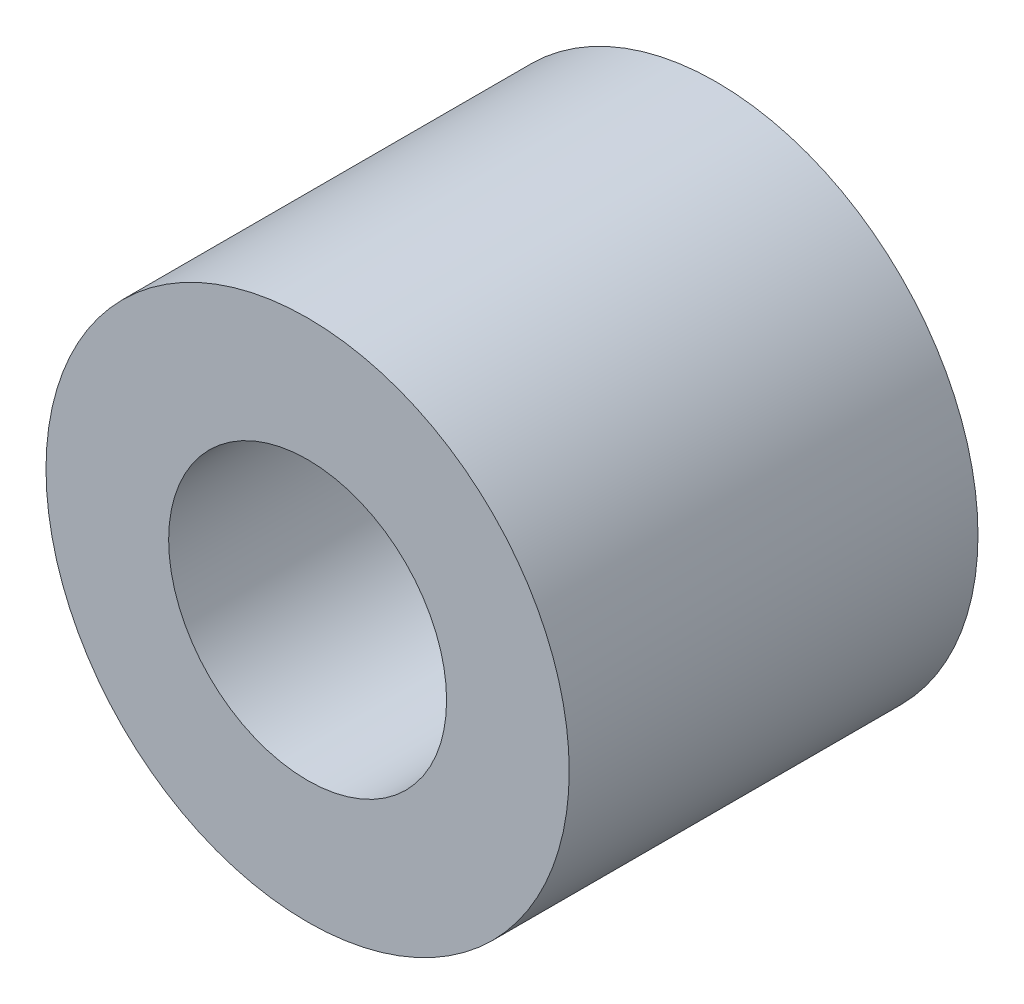
ISO-10303-21;
HEADER;
FILE_DESCRIPTION(('STEP AP214'),'2;1');
FILE_NAME('part.step','',(''),(''),'','','');
FILE_SCHEMA(('AUTOMOTIVE_DESIGN { 1 0 10303 214 1 1 1 1 }'));
ENDSEC;
DATA;
#1=APPLICATION_CONTEXT('core data for automotive mechanical design processes');
#2=APPLICATION_PROTOCOL_DEFINITION('international standard','automotive_design',2000,#1);
#3=PRODUCT_CONTEXT('',#1,'mechanical');
#4=PRODUCT('Part','Part','',(#3));
#5=PRODUCT_RELATED_PRODUCT_CATEGORY('part','',(#4));
#6=PRODUCT_DEFINITION_FORMATION('','',#4);
#7=PRODUCT_DEFINITION_CONTEXT('part definition',#1,'design');
#8=PRODUCT_DEFINITION('design','',#6,#7);
#9=PRODUCT_DEFINITION_SHAPE('','',#8);
#10=(LENGTH_UNIT() NAMED_UNIT(*) SI_UNIT(.MILLI.,.METRE.));
#11=(NAMED_UNIT(*) PLANE_ANGLE_UNIT() SI_UNIT($,.RADIAN.));
#12=(NAMED_UNIT(*) SI_UNIT($,.STERADIAN.) SOLID_ANGLE_UNIT());
#13=UNCERTAINTY_MEASURE_WITH_UNIT(LENGTH_MEASURE(1.E-05),#10,'distance_accuracy_value','');
#14=(GEOMETRIC_REPRESENTATION_CONTEXT(3) GLOBAL_UNCERTAINTY_ASSIGNED_CONTEXT((#13)) GLOBAL_UNIT_ASSIGNED_CONTEXT((#10,
#11,#12)) REPRESENTATION_CONTEXT('',''));
#15=CARTESIAN_POINT('',(0.,0.,0.));
#16=DIRECTION('',(0.,0.,1.));
#17=DIRECTION('',(1.,0.,0.));
#18=AXIS2_PLACEMENT_3D('',#15,#16,#17);
#19=CARTESIAN_POINT('',(-30.3019266469226,53.5999790383124,5.));
#20=DIRECTION('',(0.,0.,1.));
#21=DIRECTION('',(1.,0.,0.));
#22=AXIS2_PLACEMENT_3D('',#19,#20,#21);
#23=PLANE('',#22);
#24=CARTESIAN_POINT('',(-30.3019266469226,53.5999790383124,5.));
#25=DIRECTION('',(0.,0.,1.));
#26=DIRECTION('',(1.,0.,0.));
#27=AXIS2_PLACEMENT_3D('',#24,#25,#26);
#28=CIRCLE('',#27,3.2);
#29=CARTESIAN_POINT('',(-27.1019266469226,53.5999790383124,5.));
#30=VERTEX_POINT('',#29);
#31=EDGE_CURVE('E10',#30,#30,#28,.T.);
#32=ORIENTED_EDGE('',*,*,#31,.T.);
#33=EDGE_LOOP('',(#32));
#34=FACE_BOUND('',#33,.T.);
#35=CARTESIAN_POINT('',(-30.3019266469226,53.5999790383124,5.));
#36=DIRECTION('',(0.,0.,1.));
#37=DIRECTION('',(1.,0.,0.));
#38=AXIS2_PLACEMENT_3D('',#35,#36,#37);
#39=CIRCLE('',#38,1.7);
#40=CARTESIAN_POINT('',(-28.6019266469226,53.5999790383124,5.));
#41=VERTEX_POINT('',#40);
#42=EDGE_CURVE('E41',#41,#41,#39,.T.);
#43=ORIENTED_EDGE('',*,*,#42,.F.);
#44=EDGE_LOOP('',(#43));
#45=FACE_BOUND('',#44,.T.);
#46=ADVANCED_FACE('F30',(#34,#45),#23,.T.);
#47=CARTESIAN_POINT('',(-30.3019266469226,53.5999790383124,0.));
#48=DIRECTION('',(0.,0.,1.));
#49=DIRECTION('',(1.,0.,0.));
#50=AXIS2_PLACEMENT_3D('',#47,#48,#49);
#51=PLANE('',#50);
#52=CARTESIAN_POINT('',(-30.3019266469226,53.5999790383124,0.));
#53=DIRECTION('',(0.,0.,1.));
#54=DIRECTION('',(1.,0.,0.));
#55=AXIS2_PLACEMENT_3D('',#52,#53,#54);
#56=CIRCLE('',#55,3.2);
#57=CARTESIAN_POINT('',(-27.1019266469226,53.5999790383124,0.));
#58=VERTEX_POINT('',#57);
#59=EDGE_CURVE('E34',#58,#58,#56,.T.);
#60=ORIENTED_EDGE('',*,*,#59,.F.);
#61=EDGE_LOOP('',(#60));
#62=FACE_BOUND('',#61,.T.);
#63=CARTESIAN_POINT('',(-30.3019266469226,53.5999790383124,0.));
#64=DIRECTION('',(0.,0.,1.));
#65=DIRECTION('',(1.,0.,0.));
#66=AXIS2_PLACEMENT_3D('',#63,#64,#65);
#67=CIRCLE('',#66,1.7);
#68=CARTESIAN_POINT('',(-28.6019266469226,53.5999790383124,0.));
#69=VERTEX_POINT('',#68);
#70=EDGE_CURVE('E43',#69,#69,#67,.T.);
#71=ORIENTED_EDGE('',*,*,#70,.T.);
#72=EDGE_LOOP('',(#71));
#73=FACE_BOUND('',#72,.T.);
#74=ADVANCED_FACE('F53',(#62,#73),#51,.F.);
#75=CARTESIAN_POINT('',(-30.3019266469226,53.5999790383124,5.));
#76=DIRECTION('',(0.,0.,-1.));
#77=DIRECTION('',(-1.,0.,0.));
#78=AXIS2_PLACEMENT_3D('',#75,#76,#77);
#79=CYLINDRICAL_SURFACE('',#78,3.2);
#80=ORIENTED_EDGE('',*,*,#31,.F.);
#81=EDGE_LOOP('',(#80));
#82=FACE_BOUND('',#81,.T.);
#83=ORIENTED_EDGE('',*,*,#59,.T.);
#84=EDGE_LOOP('',(#83));
#85=FACE_BOUND('',#84,.T.);
#86=ADVANCED_FACE('F32',(#82,#85),#79,.T.);
#87=CARTESIAN_POINT('',(-30.3019266469226,53.5999790383124,5.));
#88=DIRECTION('',(0.,0.,-1.));
#89=DIRECTION('',(-1.,0.,0.));
#90=AXIS2_PLACEMENT_3D('',#87,#88,#89);
#91=CYLINDRICAL_SURFACE('',#90,1.7);
#92=ORIENTED_EDGE('',*,*,#42,.T.);
#93=EDGE_LOOP('',(#92));
#94=FACE_BOUND('',#93,.T.);
#95=ORIENTED_EDGE('',*,*,#70,.F.);
#96=EDGE_LOOP('',(#95));
#97=FACE_BOUND('',#96,.T.);
#98=ADVANCED_FACE('F49',(#94,#97),#91,.F.);
#99=CLOSED_SHELL('',(#46,#74,#86,#98));
#100=MANIFOLD_SOLID_BREP('B2',#99);
#101=ADVANCED_BREP_SHAPE_REPRESENTATION('',(#18,#100),#14);
#102=SHAPE_DEFINITION_REPRESENTATION(#9,#101);
ENDSEC;
END-ISO-10303-21;
